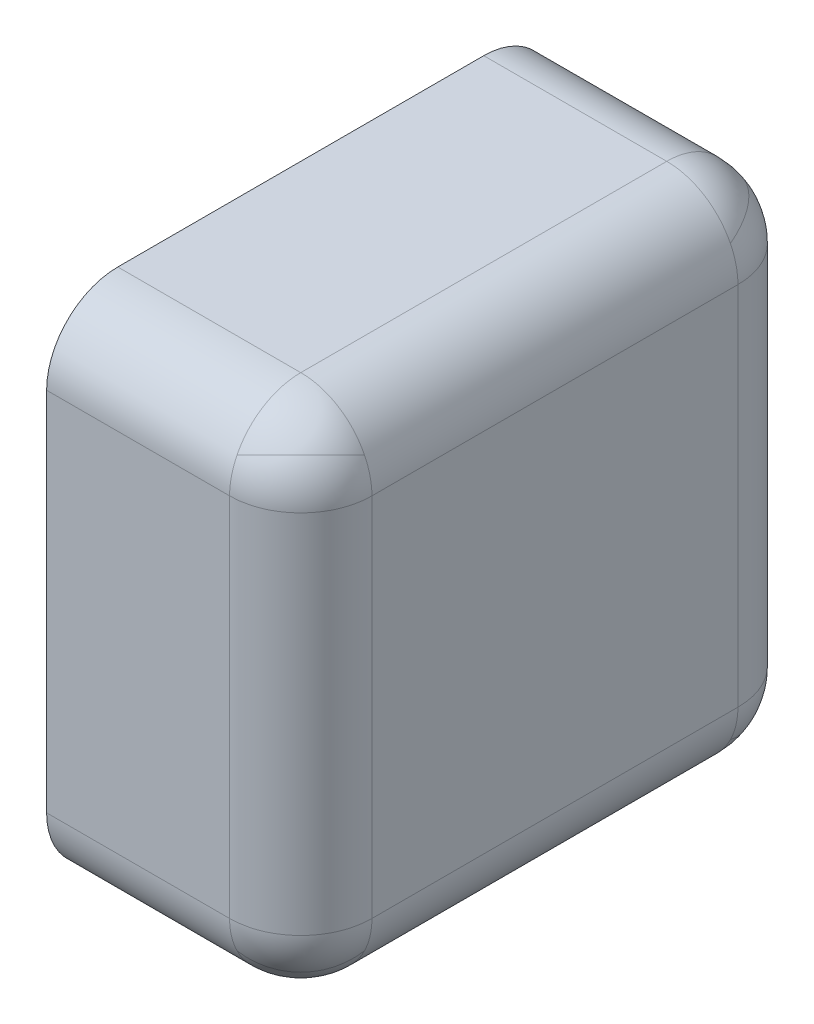
ISO-10303-21;
HEADER;
FILE_DESCRIPTION(('STEP AP214'),'2;1');
FILE_NAME('part.step','',(''),(''),'','','');
FILE_SCHEMA(('AUTOMOTIVE_DESIGN { 1 0 10303 214 1 1 1 1 }'));
ENDSEC;
DATA;
#1=APPLICATION_CONTEXT('core data for automotive mechanical design processes');
#2=APPLICATION_PROTOCOL_DEFINITION('international standard','automotive_design',2000,#1);
#3=PRODUCT_CONTEXT('',#1,'mechanical');
#4=PRODUCT('Part','Part','',(#3));
#5=PRODUCT_RELATED_PRODUCT_CATEGORY('part','',(#4));
#6=PRODUCT_DEFINITION_FORMATION('','',#4);
#7=PRODUCT_DEFINITION_CONTEXT('part definition',#1,'design');
#8=PRODUCT_DEFINITION('design','',#6,#7);
#9=PRODUCT_DEFINITION_SHAPE('','',#8);
#10=(LENGTH_UNIT() NAMED_UNIT(*) SI_UNIT(.MILLI.,.METRE.));
#11=(NAMED_UNIT(*) PLANE_ANGLE_UNIT() SI_UNIT($,.RADIAN.));
#12=(NAMED_UNIT(*) SI_UNIT($,.STERADIAN.) SOLID_ANGLE_UNIT());
#13=UNCERTAINTY_MEASURE_WITH_UNIT(LENGTH_MEASURE(1.E-05),#10,'distance_accuracy_value','');
#14=(GEOMETRIC_REPRESENTATION_CONTEXT(3) GLOBAL_UNCERTAINTY_ASSIGNED_CONTEXT((#13)) GLOBAL_UNIT_ASSIGNED_CONTEXT((#10,
#11,#12)) REPRESENTATION_CONTEXT('',''));
#15=CARTESIAN_POINT('',(0.,0.,0.));
#16=DIRECTION('',(0.,0.,1.));
#17=DIRECTION('',(1.,0.,0.));
#18=AXIS2_PLACEMENT_3D('',#15,#16,#17);
#19=CARTESIAN_POINT('',(0.470414518843274,0.220414518843274,0.0295854811567262));
#20=CARTESIAN_POINT('',(0.470414518843274,0.220414518843274,0.0295854811567262));
#21=CARTESIAN_POINT('',(0.470414518843274,0.220414518843274,0.0295854811567263));
#22=CARTESIAN_POINT('',(0.470414518843274,0.220414518843274,0.0295854811567262));
#23=CARTESIAN_POINT('',(0.453915602470369,0.220414518843274,0.0130865647838216));
#24=CARTESIAN_POINT('',(0.434864294851902,0.258517134080208,0.0321378724022887));
#25=CARTESIAN_POINT('',(0.467862127597711,0.258517134080208,0.0651357051480981));
#26=CARTESIAN_POINT('',(0.486913435216178,0.220414518843274,0.0460843975296307));
#27=CARTESIAN_POINT('',(0.433058110300326,0.214187485463227,0.00468313937387294));
#28=CARTESIAN_POINT('',(0.397113004040315,0.286077697983248,0.0406282456338839));
#29=CARTESIAN_POINT('',(0.459371754366116,0.286077697983249,0.102886995959685));
#30=CARTESIAN_POINT('',(0.495316860626127,0.214187485463227,0.0669418896996739));
#31=CARTESIAN_POINT('',(0.41256615130185,0.203143808025074,0.00627853525170235));
#32=CARTESIAN_POINT('',(0.365711109237374,0.296853892154024,0.0531335773161774));
#33=CARTESIAN_POINT('',(0.446866422683822,0.296853892154024,0.134288890762626));
#34=CARTESIAN_POINT('',(0.493721464748298,0.203143808025074,0.0874338486981501));
#35=(BOUNDED_SURFACE() B_SPLINE_SURFACE(3,3,((#19,#20,#21,#22),(#23,#24,#25,#26),(#27,#28,#29,
#30),(#31,#32,#33,#34)),.UNSPECIFIED.,.F.,.F.,.F.) B_SPLINE_SURFACE_WITH_KNOTS((4,4),(4,4),(0.,
1.),(0.,1.),.UNSPECIFIED.) GEOMETRIC_REPRESENTATION_ITEM() RATIONAL_B_SPLINE_SURFACE(((1.,
0.333333333333332,0.333333333333332,1.),(0.924501806030638,0.308167268676878,0.308167268676878,
0.924501806030638),(0.924501806030638,0.308167268676878,0.308167268676878,0.924501806030638),
(1.,0.333333333333332,0.333333333333332,1.))) REPRESENTATION_ITEM('') SURFACE());
#36=CARTESIAN_POINT('',(0.43,0.18,0.07));
#37=DIRECTION('',(0.408248290463863,-0.816496580927726,-0.408248290463864));
#38=DIRECTION('',(0.577350269189625,0.577350269189626,-0.577350269189626));
#39=AXIS2_PLACEMENT_3D('',#36,#37,#38);
#40=CIRCLE('',#39,0.07);
#41=CARTESIAN_POINT('',(0.470414518843274,0.220414518843274,0.0295854811567262));
#42=VERTEX_POINT('',#41);
#43=CARTESIAN_POINT('',(0.492609903369994,0.211304951684997,0.07));
#44=VERTEX_POINT('',#43);
#45=EDGE_CURVE('E11',#42,#44,#40,.T.);
#46=CARTESIAN_POINT('',(0.43,0.18,0.07));
#47=DIRECTION('',(-0.408248290463863,0.816496580927726,0.408248290463864));
#48=DIRECTION('',(0.577350269189625,0.577350269189627,-0.577350269189626));
#49=AXIS2_PLACEMENT_3D('',#46,#47,#48);
#50=CIRCLE('',#49,0.07);
#51=CARTESIAN_POINT('',(0.43,0.211304951684997,0.00739009663000589));
#52=VERTEX_POINT('',#51);
#53=EDGE_CURVE('E26',#42,#52,#50,.T.);
#54=CARTESIAN_POINT('',(0.43,0.18,0.07));
#55=DIRECTION('',(-1.,0.,0.));
#56=DIRECTION('',(0.,-1.,0.));
#57=AXIS2_PLACEMENT_3D('',#54,#55,#56);
#58=CIRCLE('',#57,0.07);
#59=CARTESIAN_POINT('',(0.43,0.25,0.07));
#60=VERTEX_POINT('',#59);
#61=EDGE_CURVE('E269',#60,#52,#58,.T.);
#62=CARTESIAN_POINT('',(0.43,0.18,0.07));
#63=DIRECTION('',(0.,0.,-1.));
#64=DIRECTION('',(1.,0.,0.));
#65=AXIS2_PLACEMENT_3D('',#62,#63,#64);
#66=CIRCLE('',#65,0.07);
#67=EDGE_CURVE('E267',#60,#44,#66,.T.);
#68=ORIENTED_EDGE('',*,*,#45,.F.);
#69=ORIENTED_EDGE('',*,*,#53,.T.);
#70=ORIENTED_EDGE('',*,*,#61,.F.);
#71=ORIENTED_EDGE('',*,*,#67,.T.);
#72=EDGE_LOOP('',(#68,#69,#70,#71));
#73=FACE_BOUND('',#72,.T.);
#74=ADVANCED_FACE('F17',(#73),#35,.T.);
#75=CARTESIAN_POINT('',(0.470414518843274,0.220414518843274,0.470414518843274));
#76=CARTESIAN_POINT('',(0.470414518843274,0.220414518843274,0.470414518843274));
#77=CARTESIAN_POINT('',(0.470414518843274,0.220414518843274,0.470414518843274));
#78=CARTESIAN_POINT('',(0.470414518843274,0.220414518843274,0.470414518843274));
#79=CARTESIAN_POINT('',(0.486913435216178,0.220414518843274,0.453915602470369));
#80=CARTESIAN_POINT('',(0.467862127597711,0.258517134080208,0.434864294851902));
#81=CARTESIAN_POINT('',(0.434864294851902,0.258517134080208,0.467862127597711));
#82=CARTESIAN_POINT('',(0.453915602470369,0.220414518843274,0.486913435216178));
#83=CARTESIAN_POINT('',(0.495316860626127,0.214187485463227,0.433058110300326));
#84=CARTESIAN_POINT('',(0.459371754366116,0.286077697983248,0.397113004040316));
#85=CARTESIAN_POINT('',(0.397113004040315,0.286077697983248,0.459371754366117));
#86=CARTESIAN_POINT('',(0.433058110300326,0.214187485463227,0.495316860626127));
#87=CARTESIAN_POINT('',(0.493721464748297,0.203143808025074,0.41256615130185));
#88=CARTESIAN_POINT('',(0.446866422683822,0.296853892154024,0.365711109237375));
#89=CARTESIAN_POINT('',(0.365711109237374,0.296853892154024,0.446866422683823));
#90=CARTESIAN_POINT('',(0.41256615130185,0.203143808025074,0.493721464748298));
#91=(BOUNDED_SURFACE() B_SPLINE_SURFACE(3,3,((#75,#76,#77,#78),(#79,#80,#81,#82),(#83,#84,#85,
#86),(#87,#88,#89,#90)),.UNSPECIFIED.,.F.,.F.,.F.) B_SPLINE_SURFACE_WITH_KNOTS((4,4),(4,4),(0.,
1.),(0.,1.),.UNSPECIFIED.) GEOMETRIC_REPRESENTATION_ITEM() RATIONAL_B_SPLINE_SURFACE(((1.,
0.333333333333334,0.333333333333334,1.),(0.924501806030638,0.30816726867688,0.30816726867688,
0.924501806030638),(0.924501806030638,0.30816726867688,0.30816726867688,0.924501806030638),(1.,
0.333333333333334,0.333333333333334,1.))) REPRESENTATION_ITEM('') SURFACE());
#92=CARTESIAN_POINT('',(0.43,0.18,0.43));
#93=DIRECTION('',(0.408248290463863,-0.816496580927726,0.408248290463864));
#94=DIRECTION('',(0.577350269189625,0.577350269189626,0.577350269189626));
#95=AXIS2_PLACEMENT_3D('',#92,#93,#94);
#96=CIRCLE('',#95,0.07);
#97=CARTESIAN_POINT('',(0.470414518843274,0.220414518843274,0.470414518843274));
#98=VERTEX_POINT('',#97);
#99=CARTESIAN_POINT('',(0.43,0.211304951684997,0.492609903369994));
#100=VERTEX_POINT('',#99);
#101=EDGE_CURVE('E265',#98,#100,#96,.T.);
#102=CARTESIAN_POINT('',(0.43,0.18,0.43));
#103=DIRECTION('',(-0.408248290463863,0.816496580927726,-0.408248290463864));
#104=DIRECTION('',(0.577350269189624,0.577350269189626,0.577350269189627));
#105=AXIS2_PLACEMENT_3D('',#102,#103,#104);
#106=CIRCLE('',#105,0.07);
#107=CARTESIAN_POINT('',(0.492609903369994,0.211304951684997,0.43));
#108=VERTEX_POINT('',#107);
#109=EDGE_CURVE('E263',#98,#108,#106,.T.);
#110=CARTESIAN_POINT('',(0.43,0.18,0.43));
#111=DIRECTION('',(0.,0.,-1.));
#112=DIRECTION('',(1.,0.,0.));
#113=AXIS2_PLACEMENT_3D('',#110,#111,#112);
#114=CIRCLE('',#113,0.07);
#115=CARTESIAN_POINT('',(0.43,0.25,0.43));
#116=VERTEX_POINT('',#115);
#117=EDGE_CURVE('E135',#116,#108,#114,.T.);
#118=CARTESIAN_POINT('',(0.43,0.18,0.43));
#119=DIRECTION('',(-1.,0.,0.));
#120=DIRECTION('',(0.,-1.,0.));
#121=AXIS2_PLACEMENT_3D('',#118,#119,#120);
#122=CIRCLE('',#121,0.07);
#123=EDGE_CURVE('E259',#100,#116,#122,.T.);
#124=ORIENTED_EDGE('',*,*,#101,.F.);
#125=ORIENTED_EDGE('',*,*,#109,.T.);
#126=ORIENTED_EDGE('',*,*,#117,.F.);
#127=ORIENTED_EDGE('',*,*,#123,.F.);
#128=EDGE_LOOP('',(#124,#125,#126,#127));
#129=FACE_BOUND('',#128,.T.);
#130=ADVANCED_FACE('F322',(#129),#91,.T.);
#131=CARTESIAN_POINT('',(0.470414518843274,-0.220414518843274,0.470414518843274));
#132=CARTESIAN_POINT('',(0.470414518843274,-0.220414518843274,0.470414518843274));
#133=CARTESIAN_POINT('',(0.470414518843274,-0.220414518843274,0.470414518843274));
#134=CARTESIAN_POINT('',(0.470414518843274,-0.220414518843274,0.470414518843274));
#135=CARTESIAN_POINT('',(0.486913435216178,-0.220414518843274,0.453915602470369));
#136=CARTESIAN_POINT('',(0.505964742834646,-0.182311903606339,0.472966910088837));
#137=CARTESIAN_POINT('',(0.472966910088837,-0.182311903606339,0.505964742834646));
#138=CARTESIAN_POINT('',(0.453915602470369,-0.220414518843274,0.486913435216178));
#139=CARTESIAN_POINT('',(0.495316860626127,-0.214187485463227,0.433058110300326));
#140=CARTESIAN_POINT('',(0.531261966886138,-0.142297272943205,0.469003216560337));
#141=CARTESIAN_POINT('',(0.469003216560337,-0.142297272943205,0.531261966886138));
#142=CARTESIAN_POINT('',(0.433058110300326,-0.214187485463227,0.495316860626127));
#143=CARTESIAN_POINT('',(0.493721464748298,-0.203143808025074,0.41256615130185));
#144=CARTESIAN_POINT('',(0.540576506812773,-0.109433723896123,0.459421193366325));
#145=CARTESIAN_POINT('',(0.459421193366325,-0.109433723896123,0.540576506812773));
#146=CARTESIAN_POINT('',(0.41256615130185,-0.203143808025074,0.493721464748298));
#147=(BOUNDED_SURFACE() B_SPLINE_SURFACE(3,3,((#131,#132,#133,#134),(#135,#136,#137,#138),(#139,
#140,#141,#142),(#143,#144,#145,#146)),.UNSPECIFIED.,.F.,.F.,
.F.) B_SPLINE_SURFACE_WITH_KNOTS((4,4),(4,4),(0.,1.),(0.,1.),
.UNSPECIFIED.) GEOMETRIC_REPRESENTATION_ITEM() RATIONAL_B_SPLINE_SURFACE(((1.,0.333333333333333,
0.333333333333333,1.),(0.924501806030637,0.308167268676879,0.308167268676879,0.924501806030637),
(0.924501806030637,0.308167268676879,0.308167268676879,0.924501806030637),(1.,0.333333333333333,
0.333333333333333,1.))) REPRESENTATION_ITEM('') SURFACE());
#148=CARTESIAN_POINT('',(0.43,-0.18,0.43));
#149=DIRECTION('',(-0.408248290463863,-0.816496580927726,-0.408248290463863));
#150=DIRECTION('',(0.577350269189626,-0.577350269189626,0.577350269189626));
#151=AXIS2_PLACEMENT_3D('',#148,#149,#150);
#152=CIRCLE('',#151,0.07);
#153=CARTESIAN_POINT('',(0.470414518843274,-0.220414518843274,0.470414518843274));
#154=VERTEX_POINT('',#153);
#155=CARTESIAN_POINT('',(0.43,-0.211304951684997,0.492609903369994));
#156=VERTEX_POINT('',#155);
#157=EDGE_CURVE('E257',#154,#156,#152,.T.);
#158=CARTESIAN_POINT('',(0.43,-0.18,0.43));
#159=DIRECTION('',(0.408248290463863,0.816496580927726,0.408248290463863));
#160=DIRECTION('',(0.577350269189626,-0.577350269189626,0.577350269189626));
#161=AXIS2_PLACEMENT_3D('',#158,#159,#160);
#162=CIRCLE('',#161,0.07);
#163=CARTESIAN_POINT('',(0.492609903369994,-0.211304951684997,0.43));
#164=VERTEX_POINT('',#163);
#165=EDGE_CURVE('E255',#154,#164,#162,.T.);
#166=CARTESIAN_POINT('',(0.43,-0.18,0.43));
#167=DIRECTION('',(0.,0.,1.));
#168=DIRECTION('',(1.,0.,0.));
#169=AXIS2_PLACEMENT_3D('',#166,#167,#168);
#170=CIRCLE('',#169,0.07);
#171=CARTESIAN_POINT('',(0.5,-0.18,0.43));
#172=VERTEX_POINT('',#171);
#173=EDGE_CURVE('E253',#164,#172,#170,.T.);
#174=CARTESIAN_POINT('',(0.43,-0.18,0.43));
#175=DIRECTION('',(0.,1.,0.));
#176=DIRECTION('',(-1.,0.,0.));
#177=AXIS2_PLACEMENT_3D('',#174,#175,#176);
#178=CIRCLE('',#177,0.07);
#179=CARTESIAN_POINT('',(0.43,-0.18,0.5));
#180=VERTEX_POINT('',#179);
#181=EDGE_CURVE('E163',#180,#172,#178,.T.);
#182=CARTESIAN_POINT('',(0.43,-0.18,0.43));
#183=DIRECTION('',(-1.,0.,0.));
#184=DIRECTION('',(0.,0.,-1.));
#185=AXIS2_PLACEMENT_3D('',#182,#183,#184);
#186=CIRCLE('',#185,0.07);
#187=EDGE_CURVE('E249',#156,#180,#186,.T.);
#188=ORIENTED_EDGE('',*,*,#157,.F.);
#189=ORIENTED_EDGE('',*,*,#165,.T.);
#190=ORIENTED_EDGE('',*,*,#173,.T.);
#191=ORIENTED_EDGE('',*,*,#181,.F.);
#192=ORIENTED_EDGE('',*,*,#187,.F.);
#193=EDGE_LOOP('',(#188,#189,#190,#191,#192));
#194=FACE_BOUND('',#193,.T.);
#195=ADVANCED_FACE('F326',(#194),#147,.T.);
#196=CARTESIAN_POINT('',(0.470414518843274,-0.220414518843274,0.0295854811567262));
#197=CARTESIAN_POINT('',(0.470414518843274,-0.220414518843274,0.0295854811567262));
#198=CARTESIAN_POINT('',(0.470414518843274,-0.220414518843274,0.0295854811567261));
#199=CARTESIAN_POINT('',(0.470414518843274,-0.220414518843274,0.0295854811567261));
#200=CARTESIAN_POINT('',(0.453915602470369,-0.220414518843274,0.0130865647838215));
#201=CARTESIAN_POINT('',(0.472966910088836,-0.182311903606339,-0.00596474283464581));
#202=CARTESIAN_POINT('',(0.505964742834646,-0.182311903606339,0.0270330899111635));
#203=CARTESIAN_POINT('',(0.486913435216178,-0.220414518843274,0.0460843975296308));
#204=CARTESIAN_POINT('',(0.433058110300326,-0.214187485463227,0.00468313937387292));
#205=CARTESIAN_POINT('',(0.469003216560337,-0.142297272943205,-0.0312619668861381));
#206=CARTESIAN_POINT('',(0.531261966886138,-0.142297272943205,0.0309967834396629));
#207=CARTESIAN_POINT('',(0.495316860626127,-0.214187485463227,0.0669418896996738));
#208=CARTESIAN_POINT('',(0.41256615130185,-0.203143808025074,0.00627853525170238));
#209=CARTESIAN_POINT('',(0.459421193366325,-0.109433723896123,-0.040576506812773));
#210=CARTESIAN_POINT('',(0.540576506812773,-0.109433723896123,0.0405788066336749));
#211=CARTESIAN_POINT('',(0.493721464748298,-0.203143808025074,0.0874338486981503));
#212=(BOUNDED_SURFACE() B_SPLINE_SURFACE(3,3,((#196,#197,#198,#199),(#200,#201,#202,#203),(#204,
#205,#206,#207),(#208,#209,#210,#211)),.UNSPECIFIED.,.F.,.F.,
.F.) B_SPLINE_SURFACE_WITH_KNOTS((4,4),(4,4),(0.,1.),(0.,1.),
.UNSPECIFIED.) GEOMETRIC_REPRESENTATION_ITEM() RATIONAL_B_SPLINE_SURFACE(((1.,0.333333333333333,
0.333333333333333,1.),(0.924501806030637,0.308167268676879,0.308167268676879,0.924501806030637),
(0.924501806030637,0.308167268676879,0.308167268676879,0.924501806030637),(1.,0.333333333333333,
0.333333333333333,1.))) REPRESENTATION_ITEM('') SURFACE());
#213=CARTESIAN_POINT('',(0.43,-0.18,0.07));
#214=DIRECTION('',(-0.408248290463863,-0.816496580927726,0.408248290463863));
#215=DIRECTION('',(0.577350269189626,-0.577350269189626,-0.577350269189626));
#216=AXIS2_PLACEMENT_3D('',#213,#214,#215);
#217=CIRCLE('',#216,0.07);
#218=CARTESIAN_POINT('',(0.470414518843274,-0.220414518843274,0.0295854811567262));
#219=VERTEX_POINT('',#218);
#220=CARTESIAN_POINT('',(0.492609903369994,-0.211304951684997,0.07));
#221=VERTEX_POINT('',#220);
#222=EDGE_CURVE('E247',#219,#221,#217,.T.);
#223=CARTESIAN_POINT('',(0.43,-0.18,0.0700000000000001));
#224=DIRECTION('',(0.408248290463863,0.816496580927726,-0.408248290463863));
#225=DIRECTION('',(0.577350269189626,-0.577350269189626,-0.577350269189626));
#226=AXIS2_PLACEMENT_3D('',#223,#224,#225);
#227=CIRCLE('',#226,0.07);
#228=CARTESIAN_POINT('',(0.43,-0.211304951684997,0.00739009663000594));
#229=VERTEX_POINT('',#228);
#230=EDGE_CURVE('E245',#219,#229,#227,.T.);
#231=CARTESIAN_POINT('',(0.43,-0.18,0.07));
#232=DIRECTION('',(-1.,0.,0.));
#233=DIRECTION('',(0.,0.,-1.));
#234=AXIS2_PLACEMENT_3D('',#231,#232,#233);
#235=CIRCLE('',#234,0.07);
#236=CARTESIAN_POINT('',(0.43,-0.18,0.));
#237=VERTEX_POINT('',#236);
#238=EDGE_CURVE('E242',#237,#229,#235,.T.);
#239=CARTESIAN_POINT('',(0.43,-0.18,0.07));
#240=DIRECTION('',(0.,1.,0.));
#241=DIRECTION('',(-1.,0.,0.));
#242=AXIS2_PLACEMENT_3D('',#239,#240,#241);
#243=CIRCLE('',#242,0.07);
#244=CARTESIAN_POINT('',(0.5,-0.18,0.07));
#245=VERTEX_POINT('',#244);
#246=EDGE_CURVE('E239',#245,#237,#243,.T.);
#247=CARTESIAN_POINT('',(0.43,-0.18,0.07));
#248=DIRECTION('',(0.,0.,1.));
#249=DIRECTION('',(1.,0.,0.));
#250=AXIS2_PLACEMENT_3D('',#247,#248,#249);
#251=CIRCLE('',#250,0.07);
#252=EDGE_CURVE('E236',#221,#245,#251,.T.);
#253=ORIENTED_EDGE('',*,*,#222,.F.);
#254=ORIENTED_EDGE('',*,*,#230,.T.);
#255=ORIENTED_EDGE('',*,*,#238,.F.);
#256=ORIENTED_EDGE('',*,*,#246,.F.);
#257=ORIENTED_EDGE('',*,*,#252,.F.);
#258=EDGE_LOOP('',(#253,#254,#255,#256,#257));
#259=FACE_BOUND('',#258,.T.);
#260=ADVANCED_FACE('F331',(#259),#212,.T.);
#261=CARTESIAN_POINT('',(0.25,0.25,0.));
#262=DIRECTION('',(-1.,0.,0.));
#263=DIRECTION('',(0.,0.,1.));
#264=AXIS2_PLACEMENT_3D('',#261,#262,#263);
#265=PLANE('',#264);
#266=CARTESIAN_POINT('',(0.25,0.18,0.07));
#267=DIRECTION('',(-1.,0.,0.));
#268=DIRECTION('',(0.,-1.,0.));
#269=AXIS2_PLACEMENT_3D('',#266,#267,#268);
#270=CIRCLE('',#269,0.07);
#271=CARTESIAN_POINT('',(0.25,0.25,0.07));
#272=VERTEX_POINT('',#271);
#273=CARTESIAN_POINT('',(0.25,0.18,0.));
#274=VERTEX_POINT('',#273);
#275=EDGE_CURVE('E234',#272,#274,#270,.T.);
#276=ORIENTED_EDGE('',*,*,#275,.T.);
#277=DIRECTION('',(0.,-1.,0.));
#278=VECTOR('',#277,1.);
#279=CARTESIAN_POINT('',(0.25,0.25,0.));
#280=LINE('',#279,#278);
#281=CARTESIAN_POINT('',(0.25,-0.18,0.));
#282=VERTEX_POINT('',#281);
#283=EDGE_CURVE('E232',#274,#282,#280,.T.);
#284=ORIENTED_EDGE('',*,*,#283,.T.);
#285=CARTESIAN_POINT('',(0.25,-0.18,0.07));
#286=DIRECTION('',(-1.,0.,0.));
#287=DIRECTION('',(0.,0.,-1.));
#288=AXIS2_PLACEMENT_3D('',#285,#286,#287);
#289=CIRCLE('',#288,0.07);
#290=CARTESIAN_POINT('',(0.25,-0.25,0.07));
#291=VERTEX_POINT('',#290);
#292=EDGE_CURVE('E230',#282,#291,#289,.T.);
#293=ORIENTED_EDGE('',*,*,#292,.T.);
#294=DIRECTION('',(0.,0.,1.));
#295=VECTOR('',#294,1.);
#296=CARTESIAN_POINT('',(0.25,-0.25,0.));
#297=LINE('',#296,#295);
#298=CARTESIAN_POINT('',(0.25,-0.25,0.43));
#299=VERTEX_POINT('',#298);
#300=EDGE_CURVE('E228',#291,#299,#297,.T.);
#301=ORIENTED_EDGE('',*,*,#300,.T.);
#302=CARTESIAN_POINT('',(0.25,-0.18,0.43));
#303=DIRECTION('',(-1.,0.,0.));
#304=DIRECTION('',(0.,0.,-1.));
#305=AXIS2_PLACEMENT_3D('',#302,#303,#304);
#306=CIRCLE('',#305,0.07);
#307=CARTESIAN_POINT('',(0.25,-0.18,0.5));
#308=VERTEX_POINT('',#307);
#309=EDGE_CURVE('E226',#299,#308,#306,.T.);
#310=ORIENTED_EDGE('',*,*,#309,.T.);
#311=DIRECTION('',(0.,1.,0.));
#312=VECTOR('',#311,1.);
#313=CARTESIAN_POINT('',(0.25,0.25,0.5));
#314=LINE('',#313,#312);
#315=CARTESIAN_POINT('',(0.25,0.18,0.5));
#316=VERTEX_POINT('',#315);
#317=EDGE_CURVE('E224',#308,#316,#314,.T.);
#318=ORIENTED_EDGE('',*,*,#317,.T.);
#319=CARTESIAN_POINT('',(0.25,0.18,0.43));
#320=DIRECTION('',(-1.,0.,0.));
#321=DIRECTION('',(0.,-1.,0.));
#322=AXIS2_PLACEMENT_3D('',#319,#320,#321);
#323=CIRCLE('',#322,0.07);
#324=CARTESIAN_POINT('',(0.25,0.25,0.43));
#325=VERTEX_POINT('',#324);
#326=EDGE_CURVE('E222',#316,#325,#323,.T.);
#327=ORIENTED_EDGE('',*,*,#326,.T.);
#328=DIRECTION('',(0.,0.,-1.));
#329=VECTOR('',#328,1.);
#330=CARTESIAN_POINT('',(0.25,0.25,0.));
#331=LINE('',#330,#329);
#332=EDGE_CURVE('E219',#325,#272,#331,.T.);
#333=ORIENTED_EDGE('',*,*,#332,.T.);
#334=EDGE_LOOP('',(#276,#284,#293,#301,#310,#318,#327,#333));
#335=FACE_BOUND('',#334,.T.);
#336=ADVANCED_FACE('F291',(#335),#265,.T.);
#337=CARTESIAN_POINT('',(0.375,0.,0.));
#338=DIRECTION('',(0.,0.,1.));
#339=DIRECTION('',(1.,0.,0.));
#340=AXIS2_PLACEMENT_3D('',#337,#338,#339);
#341=PLANE('',#340);
#342=ORIENTED_EDGE('',*,*,#283,.F.);
#343=DIRECTION('',(-1.,0.,0.));
#344=VECTOR('',#343,1.);
#345=CARTESIAN_POINT('',(0.375,0.18,0.));
#346=LINE('',#345,#344);
#347=CARTESIAN_POINT('',(0.43,0.18,0.));
#348=VERTEX_POINT('',#347);
#349=EDGE_CURVE('E216',#348,#274,#346,.T.);
#350=ORIENTED_EDGE('',*,*,#349,.F.);
#351=DIRECTION('',(0.,1.,0.));
#352=VECTOR('',#351,1.);
#353=CARTESIAN_POINT('',(0.43,0.,0.));
#354=LINE('',#353,#352);
#355=EDGE_CURVE('E213',#237,#348,#354,.T.);
#356=ORIENTED_EDGE('',*,*,#355,.F.);
#357=DIRECTION('',(1.,0.,0.));
#358=VECTOR('',#357,1.);
#359=CARTESIAN_POINT('',(0.375,-0.18,0.));
#360=LINE('',#359,#358);
#361=EDGE_CURVE('E210',#282,#237,#360,.T.);
#362=ORIENTED_EDGE('',*,*,#361,.F.);
#363=EDGE_LOOP('',(#342,#350,#356,#362));
#364=FACE_BOUND('',#363,.T.);
#365=ADVANCED_FACE('F283',(#364),#341,.F.);
#366=CARTESIAN_POINT('',(0.4375,0.18,0.07));
#367=DIRECTION('',(-1.,0.,0.));
#368=DIRECTION('',(0.,-1.,0.));
#369=AXIS2_PLACEMENT_3D('',#366,#367,#368);
#370=CYLINDRICAL_SURFACE('',#369,0.07);
#371=ORIENTED_EDGE('',*,*,#61,.T.);
#372=CARTESIAN_POINT('',(0.43,0.18,0.07));
#373=DIRECTION('',(-1.,0.,0.));
#374=DIRECTION('',(0.,-1.,0.));
#375=AXIS2_PLACEMENT_3D('',#372,#373,#374);
#376=CIRCLE('',#375,0.07);
#377=EDGE_CURVE('E207',#52,#348,#376,.T.);
#378=ORIENTED_EDGE('',*,*,#377,.T.);
#379=ORIENTED_EDGE('',*,*,#349,.T.);
#380=ORIENTED_EDGE('',*,*,#275,.F.);
#381=DIRECTION('',(1.,0.,0.));
#382=VECTOR('',#381,1.);
#383=CARTESIAN_POINT('',(0.4375,0.25,0.07));
#384=LINE('',#383,#382);
#385=EDGE_CURVE('E204',#272,#60,#384,.T.);
#386=ORIENTED_EDGE('',*,*,#385,.T.);
#387=EDGE_LOOP('',(#371,#378,#379,#380,#386));
#388=FACE_BOUND('',#387,.T.);
#389=ADVANCED_FACE('F273',(#388),#370,.T.);
#390=CARTESIAN_POINT('',(0.5,0.25,0.));
#391=DIRECTION('',(0.,1.,0.));
#392=DIRECTION('',(-1.,0.,0.));
#393=AXIS2_PLACEMENT_3D('',#390,#391,#392);
#394=PLANE('',#393);
#395=DIRECTION('',(1.,0.,0.));
#396=VECTOR('',#395,1.);
#397=CARTESIAN_POINT('',(0.5,0.25,0.43));
#398=LINE('',#397,#396);
#399=EDGE_CURVE('E201',#325,#116,#398,.T.);
#400=ORIENTED_EDGE('',*,*,#399,.T.);
#401=DIRECTION('',(0.,0.,-1.));
#402=VECTOR('',#401,1.);
#403=CARTESIAN_POINT('',(0.43,0.25,0.));
#404=LINE('',#403,#402);
#405=EDGE_CURVE('E198',#116,#60,#404,.T.);
#406=ORIENTED_EDGE('',*,*,#405,.T.);
#407=ORIENTED_EDGE('',*,*,#385,.F.);
#408=ORIENTED_EDGE('',*,*,#332,.F.);
#409=EDGE_LOOP('',(#400,#406,#407,#408));
#410=FACE_BOUND('',#409,.T.);
#411=ADVANCED_FACE('F311',(#410),#394,.T.);
#412=CARTESIAN_POINT('',(0.4375,0.18,0.43));
#413=DIRECTION('',(-1.,0.,0.));
#414=DIRECTION('',(0.,-1.,0.));
#415=AXIS2_PLACEMENT_3D('',#412,#413,#414);
#416=CYLINDRICAL_SURFACE('',#415,0.07);
#417=CARTESIAN_POINT('',(0.43,0.18,0.43));
#418=DIRECTION('',(-1.,0.,0.));
#419=DIRECTION('',(0.,-1.,0.));
#420=AXIS2_PLACEMENT_3D('',#417,#418,#419);
#421=CIRCLE('',#420,0.07);
#422=CARTESIAN_POINT('',(0.43,0.18,0.5));
#423=VERTEX_POINT('',#422);
#424=EDGE_CURVE('E156',#423,#100,#421,.T.);
#425=ORIENTED_EDGE('',*,*,#424,.T.);
#426=ORIENTED_EDGE('',*,*,#123,.T.);
#427=ORIENTED_EDGE('',*,*,#399,.F.);
#428=ORIENTED_EDGE('',*,*,#326,.F.);
#429=DIRECTION('',(1.,0.,0.));
#430=VECTOR('',#429,1.);
#431=CARTESIAN_POINT('',(0.4375,0.18,0.5));
#432=LINE('',#431,#430);
#433=EDGE_CURVE('E195',#316,#423,#432,.T.);
#434=ORIENTED_EDGE('',*,*,#433,.T.);
#435=EDGE_LOOP('',(#425,#426,#427,#428,#434));
#436=FACE_BOUND('',#435,.T.);
#437=ADVANCED_FACE('F307',(#436),#416,.T.);
#438=CARTESIAN_POINT('',(0.375,0.,0.5));
#439=DIRECTION('',(0.,0.,1.));
#440=DIRECTION('',(1.,0.,0.));
#441=AXIS2_PLACEMENT_3D('',#438,#439,#440);
#442=PLANE('',#441);
#443=ORIENTED_EDGE('',*,*,#433,.F.);
#444=ORIENTED_EDGE('',*,*,#317,.F.);
#445=DIRECTION('',(1.,0.,0.));
#446=VECTOR('',#445,1.);
#447=CARTESIAN_POINT('',(0.375,-0.18,0.5));
#448=LINE('',#447,#446);
#449=EDGE_CURVE('E192',#308,#180,#448,.T.);
#450=ORIENTED_EDGE('',*,*,#449,.T.);
#451=DIRECTION('',(0.,1.,0.));
#452=VECTOR('',#451,1.);
#453=CARTESIAN_POINT('',(0.43,0.,0.5));
#454=LINE('',#453,#452);
#455=EDGE_CURVE('E189',#180,#423,#454,.T.);
#456=ORIENTED_EDGE('',*,*,#455,.T.);
#457=EDGE_LOOP('',(#443,#444,#450,#456));
#458=FACE_BOUND('',#457,.T.);
#459=ADVANCED_FACE('F305',(#458),#442,.T.);
#460=CARTESIAN_POINT('',(0.3125,-0.18,0.43));
#461=DIRECTION('',(1.,0.,0.));
#462=DIRECTION('',(0.,0.,-1.));
#463=AXIS2_PLACEMENT_3D('',#460,#461,#462);
#464=CYLINDRICAL_SURFACE('',#463,0.07);
#465=CARTESIAN_POINT('',(0.43,-0.18,0.43));
#466=DIRECTION('',(-1.,0.,0.));
#467=DIRECTION('',(0.,0.,-1.));
#468=AXIS2_PLACEMENT_3D('',#465,#466,#467);
#469=CIRCLE('',#468,0.07);
#470=CARTESIAN_POINT('',(0.43,-0.25,0.43));
#471=VERTEX_POINT('',#470);
#472=EDGE_CURVE('E186',#471,#156,#469,.T.);
#473=ORIENTED_EDGE('',*,*,#472,.T.);
#474=ORIENTED_EDGE('',*,*,#187,.T.);
#475=ORIENTED_EDGE('',*,*,#449,.F.);
#476=ORIENTED_EDGE('',*,*,#309,.F.);
#477=DIRECTION('',(1.,0.,0.));
#478=VECTOR('',#477,1.);
#479=CARTESIAN_POINT('',(0.3125,-0.25,0.43));
#480=LINE('',#479,#478);
#481=EDGE_CURVE('E183',#299,#471,#480,.T.);
#482=ORIENTED_EDGE('',*,*,#481,.T.);
#483=EDGE_LOOP('',(#473,#474,#475,#476,#482));
#484=FACE_BOUND('',#483,.T.);
#485=ADVANCED_FACE('F299',(#484),#464,.T.);
#486=CARTESIAN_POINT('',(0.25,-0.25,0.));
#487=DIRECTION('',(0.,-1.,0.));
#488=DIRECTION('',(0.,0.,-1.));
#489=AXIS2_PLACEMENT_3D('',#486,#487,#488);
#490=PLANE('',#489);
#491=ORIENTED_EDGE('',*,*,#481,.F.);
#492=ORIENTED_EDGE('',*,*,#300,.F.);
#493=DIRECTION('',(1.,0.,0.));
#494=VECTOR('',#493,1.);
#495=CARTESIAN_POINT('',(0.25,-0.25,0.07));
#496=LINE('',#495,#494);
#497=CARTESIAN_POINT('',(0.43,-0.25,0.07));
#498=VERTEX_POINT('',#497);
#499=EDGE_CURVE('E181',#291,#498,#496,.T.);
#500=ORIENTED_EDGE('',*,*,#499,.T.);
#501=DIRECTION('',(0.,0.,1.));
#502=VECTOR('',#501,1.);
#503=CARTESIAN_POINT('',(0.43,-0.25,0.));
#504=LINE('',#503,#502);
#505=EDGE_CURVE('E178',#498,#471,#504,.T.);
#506=ORIENTED_EDGE('',*,*,#505,.T.);
#507=EDGE_LOOP('',(#491,#492,#500,#506));
#508=FACE_BOUND('',#507,.T.);
#509=ADVANCED_FACE('F295',(#508),#490,.T.);
#510=CARTESIAN_POINT('',(0.3125,-0.18,0.07));
#511=DIRECTION('',(1.,0.,0.));
#512=DIRECTION('',(0.,0.,-1.));
#513=AXIS2_PLACEMENT_3D('',#510,#511,#512);
#514=CYLINDRICAL_SURFACE('',#513,0.07);
#515=ORIENTED_EDGE('',*,*,#238,.T.);
#516=CARTESIAN_POINT('',(0.43,-0.18,0.07));
#517=DIRECTION('',(-1.,0.,0.));
#518=DIRECTION('',(0.,0.,-1.));
#519=AXIS2_PLACEMENT_3D('',#516,#517,#518);
#520=CIRCLE('',#519,0.07);
#521=EDGE_CURVE('E175',#229,#498,#520,.T.);
#522=ORIENTED_EDGE('',*,*,#521,.T.);
#523=ORIENTED_EDGE('',*,*,#499,.F.);
#524=ORIENTED_EDGE('',*,*,#292,.F.);
#525=ORIENTED_EDGE('',*,*,#361,.T.);
#526=EDGE_LOOP('',(#515,#522,#523,#524,#525));
#527=FACE_BOUND('',#526,.T.);
#528=ADVANCED_FACE('F286',(#527),#514,.T.);
#529=CARTESIAN_POINT('',(0.43,-0.125,0.07));
#530=DIRECTION('',(0.,1.,0.));
#531=DIRECTION('',(-1.,0.,0.));
#532=AXIS2_PLACEMENT_3D('',#529,#530,#531);
#533=CYLINDRICAL_SURFACE('',#532,0.07);
#534=ORIENTED_EDGE('',*,*,#246,.T.);
#535=ORIENTED_EDGE('',*,*,#355,.T.);
#536=CARTESIAN_POINT('',(0.43,0.18,0.07));
#537=DIRECTION('',(0.,-1.,0.));
#538=DIRECTION('',(-1.,0.,0.));
#539=AXIS2_PLACEMENT_3D('',#536,#537,#538);
#540=CIRCLE('',#539,0.07);
#541=CARTESIAN_POINT('',(0.5,0.18,0.07));
#542=VERTEX_POINT('',#541);
#543=EDGE_CURVE('E173',#348,#542,#540,.T.);
#544=ORIENTED_EDGE('',*,*,#543,.T.);
#545=DIRECTION('',(0.,-1.,0.));
#546=VECTOR('',#545,1.);
#547=CARTESIAN_POINT('',(0.5,-0.125,0.07));
#548=LINE('',#547,#546);
#549=EDGE_CURVE('E150',#542,#245,#548,.T.);
#550=ORIENTED_EDGE('',*,*,#549,.T.);
#551=EDGE_LOOP('',(#534,#535,#544,#550));
#552=FACE_BOUND('',#551,.T.);
#553=ADVANCED_FACE('F278',(#552),#533,.T.);
#554=CARTESIAN_POINT('',(0.470414518843274,0.220414518843274,0.0295854811567262));
#555=CARTESIAN_POINT('',(0.470414518843274,0.220414518843274,0.0295854811567262));
#556=CARTESIAN_POINT('',(0.470414518843274,0.220414518843274,0.0295854811567263));
#557=CARTESIAN_POINT('',(0.470414518843274,0.220414518843274,0.0295854811567263));
#558=CARTESIAN_POINT('',(0.486913435216178,0.220414518843274,0.0460843975296308));
#559=CARTESIAN_POINT('',(0.505964742834645,0.182311903606339,0.0270330899111636));
#560=CARTESIAN_POINT('',(0.472966910088836,0.182311903606339,-0.00596474283464544));
#561=CARTESIAN_POINT('',(0.453915602470369,0.220414518843274,0.0130865647838216));
#562=CARTESIAN_POINT('',(0.495316860626127,0.214187485463227,0.0669418896996738));
#563=CARTESIAN_POINT('',(0.531261966886138,0.142297272943205,0.0309967834396629));
#564=CARTESIAN_POINT('',(0.469003216560337,0.142297272943205,-0.0312619668861378));
#565=CARTESIAN_POINT('',(0.433058110300326,0.214187485463226,0.00468313937387302));
#566=CARTESIAN_POINT('',(0.493721464748298,0.203143808025074,0.0874338486981503));
#567=CARTESIAN_POINT('',(0.540576506812773,0.109433723896123,0.040578806633675));
#568=CARTESIAN_POINT('',(0.459421193366325,0.109433723896124,-0.0405765068127727));
#569=CARTESIAN_POINT('',(0.41256615130185,0.203143808025074,0.00627853525170241));
#570=(BOUNDED_SURFACE() B_SPLINE_SURFACE(3,3,((#554,#555,#556,#557),(#558,#559,#560,#561),(#562,
#563,#564,#565),(#566,#567,#568,#569)),.UNSPECIFIED.,.F.,.F.,
.F.) B_SPLINE_SURFACE_WITH_KNOTS((4,4),(4,4),(0.,1.),(0.,1.),
.UNSPECIFIED.) GEOMETRIC_REPRESENTATION_ITEM() RATIONAL_B_SPLINE_SURFACE(((1.,0.333333333333334,
0.333333333333334,1.),(0.924501806030637,0.30816726867688,0.30816726867688,0.924501806030637),
(0.924501806030637,0.30816726867688,0.30816726867688,0.924501806030637),(1.,0.333333333333334,
0.333333333333334,1.))) REPRESENTATION_ITEM('') SURFACE());
#571=CARTESIAN_POINT('',(0.43,0.18,0.07));
#572=DIRECTION('',(0.,0.,-1.));
#573=DIRECTION('',(1.,0.,0.));
#574=AXIS2_PLACEMENT_3D('',#571,#572,#573);
#575=CIRCLE('',#574,0.07);
#576=EDGE_CURVE('E139',#44,#542,#575,.T.);
#577=ORIENTED_EDGE('',*,*,#53,.F.);
#578=ORIENTED_EDGE('',*,*,#45,.T.);
#579=ORIENTED_EDGE('',*,*,#576,.T.);
#580=ORIENTED_EDGE('',*,*,#543,.F.);
#581=ORIENTED_EDGE('',*,*,#377,.F.);
#582=EDGE_LOOP('',(#577,#578,#579,#580,#581));
#583=FACE_BOUND('',#582,.T.);
#584=ADVANCED_FACE('F276',(#583),#570,.T.);
#585=CARTESIAN_POINT('',(0.43,0.18,0.));
#586=DIRECTION('',(0.,0.,1.));
#587=DIRECTION('',(1.,0.,0.));
#588=AXIS2_PLACEMENT_3D('',#585,#586,#587);
#589=CYLINDRICAL_SURFACE('',#588,0.07);
#590=ORIENTED_EDGE('',*,*,#67,.F.);
#591=ORIENTED_EDGE('',*,*,#405,.F.);
#592=ORIENTED_EDGE('',*,*,#117,.T.);
#593=CARTESIAN_POINT('',(0.43,0.18,0.43));
#594=DIRECTION('',(0.,0.,-1.));
#595=DIRECTION('',(1.,0.,0.));
#596=AXIS2_PLACEMENT_3D('',#593,#594,#595);
#597=CIRCLE('',#596,0.07);
#598=CARTESIAN_POINT('',(0.5,0.18,0.43));
#599=VERTEX_POINT('',#598);
#600=EDGE_CURVE('E128',#108,#599,#597,.T.);
#601=ORIENTED_EDGE('',*,*,#600,.T.);
#602=DIRECTION('',(0.,0.,-1.));
#603=VECTOR('',#602,1.);
#604=CARTESIAN_POINT('',(0.5,0.18,0.));
#605=LINE('',#604,#603);
#606=EDGE_CURVE('E133',#599,#542,#605,.T.);
#607=ORIENTED_EDGE('',*,*,#606,.T.);
#608=ORIENTED_EDGE('',*,*,#576,.F.);
#609=EDGE_LOOP('',(#590,#591,#592,#601,#607,#608));
#610=FACE_BOUND('',#609,.T.);
#611=ADVANCED_FACE('F131',(#610),#589,.T.);
#612=CARTESIAN_POINT('',(0.470414518843274,0.220414518843274,0.470414518843274));
#613=CARTESIAN_POINT('',(0.470414518843274,0.220414518843274,0.470414518843274));
#614=CARTESIAN_POINT('',(0.470414518843274,0.220414518843274,0.470414518843274));
#615=CARTESIAN_POINT('',(0.470414518843274,0.220414518843274,0.470414518843274));
#616=CARTESIAN_POINT('',(0.453915602470369,0.220414518843274,0.486913435216178));
#617=CARTESIAN_POINT('',(0.472966910088836,0.182311903606339,0.505964742834646));
#618=CARTESIAN_POINT('',(0.505964742834646,0.182311903606339,0.472966910088836));
#619=CARTESIAN_POINT('',(0.486913435216178,0.220414518843274,0.453915602470369));
#620=CARTESIAN_POINT('',(0.433058110300326,0.214187485463227,0.495316860626127));
#621=CARTESIAN_POINT('',(0.469003216560337,0.142297272943204,0.531261966886139));
#622=CARTESIAN_POINT('',(0.531261966886139,0.142297272943205,0.469003216560337));
#623=CARTESIAN_POINT('',(0.495316860626127,0.214187485463227,0.433058110300326));
#624=CARTESIAN_POINT('',(0.412566151301849,0.203143808025074,0.493721464748297));
#625=CARTESIAN_POINT('',(0.459421193366325,0.109433723896123,0.540576506812773));
#626=CARTESIAN_POINT('',(0.540576506812773,0.109433723896123,0.459421193366325));
#627=CARTESIAN_POINT('',(0.493721464748297,0.203143808025074,0.41256615130185));
#628=(BOUNDED_SURFACE() B_SPLINE_SURFACE(3,3,((#612,#613,#614,#615),(#616,#617,#618,#619),(#620,
#621,#622,#623),(#624,#625,#626,#627)),.UNSPECIFIED.,.F.,.F.,
.F.) B_SPLINE_SURFACE_WITH_KNOTS((4,4),(4,4),(0.,1.),(0.,1.),
.UNSPECIFIED.) GEOMETRIC_REPRESENTATION_ITEM() RATIONAL_B_SPLINE_SURFACE(((1.,0.333333333333331,
0.333333333333331,1.),(0.924501806030637,0.308167268676877,0.308167268676877,0.924501806030637),
(0.924501806030637,0.308167268676877,0.308167268676877,0.924501806030637),(1.,0.333333333333331,
0.333333333333331,1.))) REPRESENTATION_ITEM('') SURFACE());
#629=CARTESIAN_POINT('',(0.43,0.18,0.43));
#630=DIRECTION('',(0.,1.,0.));
#631=DIRECTION('',(-1.,0.,0.));
#632=AXIS2_PLACEMENT_3D('',#629,#630,#631);
#633=CIRCLE('',#632,0.07);
#634=EDGE_CURVE('E151',#423,#599,#633,.T.);
#635=ORIENTED_EDGE('',*,*,#109,.F.);
#636=ORIENTED_EDGE('',*,*,#101,.T.);
#637=ORIENTED_EDGE('',*,*,#424,.F.);
#638=ORIENTED_EDGE('',*,*,#634,.T.);
#639=ORIENTED_EDGE('',*,*,#600,.F.);
#640=EDGE_LOOP('',(#635,#636,#637,#638,#639));
#641=FACE_BOUND('',#640,.T.);
#642=ADVANCED_FACE('F154',(#641),#628,.T.);
#643=CARTESIAN_POINT('',(0.43,-0.125,0.43));
#644=DIRECTION('',(0.,1.,0.));
#645=DIRECTION('',(-1.,0.,0.));
#646=AXIS2_PLACEMENT_3D('',#643,#644,#645);
#647=CYLINDRICAL_SURFACE('',#646,0.07);
#648=ORIENTED_EDGE('',*,*,#181,.T.);
#649=DIRECTION('',(0.,1.,0.));
#650=VECTOR('',#649,1.);
#651=CARTESIAN_POINT('',(0.5,-0.125,0.43));
#652=LINE('',#651,#650);
#653=EDGE_CURVE('E147',#172,#599,#652,.T.);
#654=ORIENTED_EDGE('',*,*,#653,.T.);
#655=ORIENTED_EDGE('',*,*,#634,.F.);
#656=ORIENTED_EDGE('',*,*,#455,.F.);
#657=EDGE_LOOP('',(#648,#654,#655,#656));
#658=FACE_BOUND('',#657,.T.);
#659=ADVANCED_FACE('F162',(#658),#647,.T.);
#660=CARTESIAN_POINT('',(0.470414518843274,-0.220414518843274,0.470414518843274));
#661=CARTESIAN_POINT('',(0.470414518843274,-0.220414518843274,0.470414518843274));
#662=CARTESIAN_POINT('',(0.470414518843274,-0.220414518843274,0.470414518843274));
#663=CARTESIAN_POINT('',(0.470414518843274,-0.220414518843274,0.470414518843274));
#664=CARTESIAN_POINT('',(0.453915602470369,-0.220414518843274,0.486913435216178));
#665=CARTESIAN_POINT('',(0.434864294851902,-0.258517134080208,0.467862127597711));
#666=CARTESIAN_POINT('',(0.467862127597711,-0.258517134080208,0.434864294851902));
#667=CARTESIAN_POINT('',(0.486913435216178,-0.220414518843274,0.453915602470369));
#668=CARTESIAN_POINT('',(0.433058110300326,-0.214187485463227,0.495316860626127));
#669=CARTESIAN_POINT('',(0.397113004040316,-0.286077697983248,0.459371754366116));
#670=CARTESIAN_POINT('',(0.459371754366116,-0.286077697983248,0.397113004040316));
#671=CARTESIAN_POINT('',(0.495316860626127,-0.214187485463227,0.433058110300326));
#672=CARTESIAN_POINT('',(0.41256615130185,-0.203143808025074,0.493721464748297));
#673=CARTESIAN_POINT('',(0.365711109237375,-0.296853892154024,0.446866422683822));
#674=CARTESIAN_POINT('',(0.446866422683823,-0.296853892154024,0.365711109237374));
#675=CARTESIAN_POINT('',(0.493721464748298,-0.203143808025074,0.41256615130185));
#676=(BOUNDED_SURFACE() B_SPLINE_SURFACE(3,3,((#660,#661,#662,#663),(#664,#665,#666,#667),(#668,
#669,#670,#671),(#672,#673,#674,#675)),.UNSPECIFIED.,.F.,.F.,
.F.) B_SPLINE_SURFACE_WITH_KNOTS((4,4),(4,4),(0.,1.),(0.,1.),
.UNSPECIFIED.) GEOMETRIC_REPRESENTATION_ITEM() RATIONAL_B_SPLINE_SURFACE(((1.,0.333333333333333,
0.333333333333333,1.),(0.924501806030638,0.308167268676879,0.308167268676879,0.924501806030638),
(0.924501806030638,0.308167268676879,0.308167268676879,0.924501806030638),(1.,0.333333333333333,
0.333333333333333,1.))) REPRESENTATION_ITEM('') SURFACE());
#677=CARTESIAN_POINT('',(0.43,-0.18,0.43));
#678=DIRECTION('',(0.,0.,1.));
#679=DIRECTION('',(1.,0.,0.));
#680=AXIS2_PLACEMENT_3D('',#677,#678,#679);
#681=CIRCLE('',#680,0.07);
#682=EDGE_CURVE('E164',#471,#164,#681,.T.);
#683=ORIENTED_EDGE('',*,*,#165,.F.);
#684=ORIENTED_EDGE('',*,*,#157,.T.);
#685=ORIENTED_EDGE('',*,*,#472,.F.);
#686=ORIENTED_EDGE('',*,*,#682,.T.);
#687=EDGE_LOOP('',(#683,#684,#685,#686));
#688=FACE_BOUND('',#687,.T.);
#689=ADVANCED_FACE('F458',(#688),#676,.T.);
#690=CARTESIAN_POINT('',(0.43,-0.18,0.));
#691=DIRECTION('',(0.,0.,1.));
#692=DIRECTION('',(1.,0.,0.));
#693=AXIS2_PLACEMENT_3D('',#690,#691,#692);
#694=CYLINDRICAL_SURFACE('',#693,0.07);
#695=CARTESIAN_POINT('',(0.43,-0.18,0.07));
#696=DIRECTION('',(0.,0.,1.));
#697=DIRECTION('',(1.,0.,0.));
#698=AXIS2_PLACEMENT_3D('',#695,#696,#697);
#699=CIRCLE('',#698,0.07);
#700=EDGE_CURVE('E167',#498,#221,#699,.T.);
#701=ORIENTED_EDGE('',*,*,#700,.T.);
#702=ORIENTED_EDGE('',*,*,#252,.T.);
#703=DIRECTION('',(0.,0.,1.));
#704=VECTOR('',#703,1.);
#705=CARTESIAN_POINT('',(0.5,-0.18,0.));
#706=LINE('',#705,#704);
#707=EDGE_CURVE('E533',#245,#172,#706,.T.);
#708=ORIENTED_EDGE('',*,*,#707,.T.);
#709=ORIENTED_EDGE('',*,*,#173,.F.);
#710=ORIENTED_EDGE('',*,*,#682,.F.);
#711=ORIENTED_EDGE('',*,*,#505,.F.);
#712=EDGE_LOOP('',(#701,#702,#708,#709,#710,#711));
#713=FACE_BOUND('',#712,.T.);
#714=ADVANCED_FACE('F467',(#713),#694,.T.);
#715=CARTESIAN_POINT('',(0.470414518843274,-0.220414518843274,0.0295854811567262));
#716=CARTESIAN_POINT('',(0.470414518843274,-0.220414518843274,0.0295854811567262));
#717=CARTESIAN_POINT('',(0.470414518843274,-0.220414518843274,0.0295854811567261));
#718=CARTESIAN_POINT('',(0.470414518843274,-0.220414518843274,0.0295854811567262));
#719=CARTESIAN_POINT('',(0.486913435216178,-0.220414518843274,0.0460843975296308));
#720=CARTESIAN_POINT('',(0.467862127597711,-0.258517134080208,0.065135705148098));
#721=CARTESIAN_POINT('',(0.434864294851902,-0.258517134080208,0.0321378724022888));
#722=CARTESIAN_POINT('',(0.453915602470369,-0.220414518843274,0.0130865647838215));
#723=CARTESIAN_POINT('',(0.495316860626127,-0.214187485463227,0.0669418896996738));
#724=CARTESIAN_POINT('',(0.459371754366116,-0.286077697983248,0.102886995959685));
#725=CARTESIAN_POINT('',(0.397113004040316,-0.286077697983248,0.0406282456338838));
#726=CARTESIAN_POINT('',(0.433058110300326,-0.214187485463227,0.00468313937387291));
#727=CARTESIAN_POINT('',(0.493721464748298,-0.203143808025074,0.0874338486981502));
#728=CARTESIAN_POINT('',(0.446866422683823,-0.296853892154024,0.134288890762625));
#729=CARTESIAN_POINT('',(0.365711109237375,-0.296853892154024,0.0531335773161776));
#730=CARTESIAN_POINT('',(0.41256615130185,-0.203143808025074,0.0062785352517023));
#731=(BOUNDED_SURFACE() B_SPLINE_SURFACE(3,3,((#715,#716,#717,#718),(#719,#720,#721,#722),(#723,
#724,#725,#726),(#727,#728,#729,#730)),.UNSPECIFIED.,.F.,.F.,
.F.) B_SPLINE_SURFACE_WITH_KNOTS((4,4),(4,4),(0.,1.),(0.,1.),
.UNSPECIFIED.) GEOMETRIC_REPRESENTATION_ITEM() RATIONAL_B_SPLINE_SURFACE(((1.,0.333333333333334,
0.333333333333334,1.),(0.924501806030638,0.30816726867688,0.30816726867688,0.924501806030638),
(0.924501806030638,0.30816726867688,0.30816726867688,0.924501806030638),(1.,0.333333333333334,
0.333333333333334,1.))) REPRESENTATION_ITEM('') SURFACE());
#732=ORIENTED_EDGE('',*,*,#230,.F.);
#733=ORIENTED_EDGE('',*,*,#222,.T.);
#734=ORIENTED_EDGE('',*,*,#700,.F.);
#735=ORIENTED_EDGE('',*,*,#521,.F.);
#736=EDGE_LOOP('',(#732,#733,#734,#735));
#737=FACE_BOUND('',#736,.T.);
#738=ADVANCED_FACE('F477',(#737),#731,.T.);
#739=CARTESIAN_POINT('',(0.5,-0.25,0.));
#740=DIRECTION('',(1.,0.,0.));
#741=DIRECTION('',(0.,1.,0.));
#742=AXIS2_PLACEMENT_3D('',#739,#740,#741);
#743=PLANE('',#742);
#744=ORIENTED_EDGE('',*,*,#653,.F.);
#745=ORIENTED_EDGE('',*,*,#707,.F.);
#746=ORIENTED_EDGE('',*,*,#549,.F.);
#747=ORIENTED_EDGE('',*,*,#606,.F.);
#748=EDGE_LOOP('',(#744,#745,#746,#747));
#749=FACE_BOUND('',#748,.T.);
#750=ADVANCED_FACE('F144',(#749),#743,.T.);
#751=CLOSED_SHELL('',(#74,#130,#195,#260,#336,#365,#389,#411,#437,#459,#485,#509,#528,#553,#584,
#611,#642,#659,#689,#714,#738,#750));
#752=MANIFOLD_SOLID_BREP('B1',#751);
#753=ADVANCED_BREP_SHAPE_REPRESENTATION('',(#18,#752),#14);
#754=SHAPE_DEFINITION_REPRESENTATION(#9,#753);
ENDSEC;
END-ISO-10303-21;
